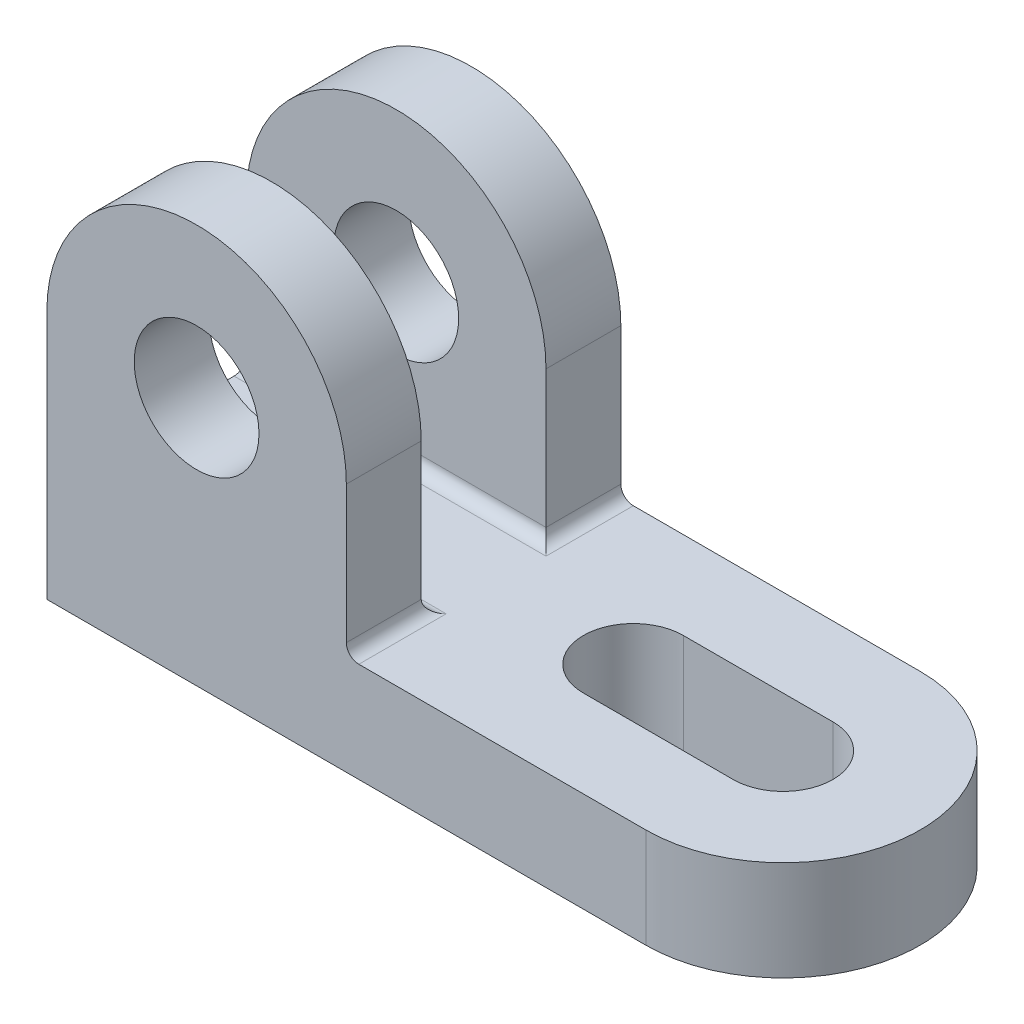
ISO-10303-21;
HEADER;
FILE_DESCRIPTION(('STEP AP214'),'2;1');
FILE_NAME('part.step','',(''),(''),'','','');
FILE_SCHEMA(('AUTOMOTIVE_DESIGN { 1 0 10303 214 1 1 1 1 }'));
ENDSEC;
DATA;
#1=APPLICATION_CONTEXT('core data for automotive mechanical design processes');
#2=APPLICATION_PROTOCOL_DEFINITION('international standard','automotive_design',2000,#1);
#3=PRODUCT_CONTEXT('',#1,'mechanical');
#4=PRODUCT('Part','Part','',(#3));
#5=PRODUCT_RELATED_PRODUCT_CATEGORY('part','',(#4));
#6=PRODUCT_DEFINITION_FORMATION('','',#4);
#7=PRODUCT_DEFINITION_CONTEXT('part definition',#1,'design');
#8=PRODUCT_DEFINITION('design','',#6,#7);
#9=PRODUCT_DEFINITION_SHAPE('','',#8);
#10=(LENGTH_UNIT() NAMED_UNIT(*) SI_UNIT(.MILLI.,.METRE.));
#11=(NAMED_UNIT(*) PLANE_ANGLE_UNIT() SI_UNIT($,.RADIAN.));
#12=(NAMED_UNIT(*) SI_UNIT($,.STERADIAN.) SOLID_ANGLE_UNIT());
#13=UNCERTAINTY_MEASURE_WITH_UNIT(LENGTH_MEASURE(1.E-05),#10,'distance_accuracy_value','');
#14=(GEOMETRIC_REPRESENTATION_CONTEXT(3) GLOBAL_UNCERTAINTY_ASSIGNED_CONTEXT((#13)) GLOBAL_UNIT_ASSIGNED_CONTEXT((#10,
#11,#12)) REPRESENTATION_CONTEXT('',''));
#15=CARTESIAN_POINT('',(0.,0.,0.));
#16=DIRECTION('',(0.,0.,1.));
#17=DIRECTION('',(1.,0.,0.));
#18=AXIS2_PLACEMENT_3D('',#15,#16,#17);
#19=CARTESIAN_POINT('',(24.,40.,-44.));
#20=DIRECTION('',(0.,0.,1.));
#21=DIRECTION('',(1.,0.,0.));
#22=AXIS2_PLACEMENT_3D('',#19,#20,#21);
#23=CYLINDRICAL_SURFACE('',#22,24.);
#24=CARTESIAN_POINT('',(24.,40.,-12.));
#25=DIRECTION('',(0.,0.,1.));
#26=DIRECTION('',(0.,-1.,0.));
#27=AXIS2_PLACEMENT_3D('',#24,#25,#26);
#28=CIRCLE('',#27,24.);
#29=CARTESIAN_POINT('',(0.,40.,-12.));
#30=VERTEX_POINT('',#29);
#31=CARTESIAN_POINT('',(48.,40.,-12.));
#32=VERTEX_POINT('',#31);
#33=EDGE_CURVE('E189',#30,#32,#28,.F.);
#34=ORIENTED_EDGE('',*,*,#33,.F.);
#35=DIRECTION('',(0.,0.,1.));
#36=VECTOR('',#35,1.);
#37=CARTESIAN_POINT('',(0.,40.,-44.));
#38=LINE('',#37,#36);
#39=CARTESIAN_POINT('',(0.,40.,0.));
#40=VERTEX_POINT('',#39);
#41=EDGE_CURVE('E203',#30,#40,#38,.T.);
#42=ORIENTED_EDGE('',*,*,#41,.T.);
#43=CARTESIAN_POINT('',(24.,40.,0.));
#44=DIRECTION('',(0.,0.,1.));
#45=DIRECTION('',(1.,0.,0.));
#46=AXIS2_PLACEMENT_3D('',#43,#44,#45);
#47=CIRCLE('',#46,24.);
#48=CARTESIAN_POINT('',(48.,40.,0.));
#49=VERTEX_POINT('',#48);
#50=EDGE_CURVE('E227',#49,#40,#47,.T.);
#51=ORIENTED_EDGE('',*,*,#50,.F.);
#52=DIRECTION('',(0.,0.,1.));
#53=VECTOR('',#52,1.);
#54=CARTESIAN_POINT('',(48.,40.,-44.));
#55=LINE('',#54,#53);
#56=EDGE_CURVE('E206',#32,#49,#55,.T.);
#57=ORIENTED_EDGE('',*,*,#56,.F.);
#58=EDGE_LOOP('',(#34,#42,#51,#57));
#59=FACE_BOUND('',#58,.T.);
#60=ADVANCED_FACE('F63',(#59),#23,.T.);
#61=CARTESIAN_POINT('',(48.,16.,-44.));
#62=DIRECTION('',(1.,0.,0.));
#63=DIRECTION('',(0.,0.,-1.));
#64=AXIS2_PLACEMENT_3D('',#61,#62,#63);
#65=PLANE('',#64);
#66=DIRECTION('',(0.,1.,0.));
#67=VECTOR('',#66,1.);
#68=CARTESIAN_POINT('',(48.,16.,-32.));
#69=LINE('',#68,#67);
#70=CARTESIAN_POINT('',(48.,18.,-32.));
#71=VERTEX_POINT('',#70);
#72=CARTESIAN_POINT('',(48.,40.,-32.));
#73=VERTEX_POINT('',#72);
#74=EDGE_CURVE('E350',#71,#73,#69,.T.);
#75=ORIENTED_EDGE('',*,*,#74,.F.);
#76=DIRECTION('',(0.,0.,1.));
#77=VECTOR('',#76,1.);
#78=CARTESIAN_POINT('',(48.,18.,-44.));
#79=LINE('',#78,#77);
#80=CARTESIAN_POINT('',(48.,18.,-44.));
#81=VERTEX_POINT('',#80);
#82=EDGE_CURVE('E87',#71,#81,#79,.F.);
#83=ORIENTED_EDGE('',*,*,#82,.T.);
#84=DIRECTION('',(0.,1.,0.));
#85=VECTOR('',#84,1.);
#86=CARTESIAN_POINT('',(48.,16.,-44.));
#87=LINE('',#86,#85);
#88=CARTESIAN_POINT('',(48.,40.,-44.));
#89=VERTEX_POINT('',#88);
#90=EDGE_CURVE('E388',#81,#89,#87,.T.);
#91=ORIENTED_EDGE('',*,*,#90,.T.);
#92=EDGE_CURVE('E218',#89,#73,#55,.T.);
#93=ORIENTED_EDGE('',*,*,#92,.T.);
#94=EDGE_LOOP('',(#75,#83,#91,#93));
#95=FACE_BOUND('',#94,.T.);
#96=ADVANCED_FACE('F424',(#95),#65,.T.);
#97=CARTESIAN_POINT('',(24.,40.,-44.));
#98=DIRECTION('',(0.,0.,1.));
#99=DIRECTION('',(1.,0.,0.));
#100=AXIS2_PLACEMENT_3D('',#97,#98,#99);
#101=CYLINDRICAL_SURFACE('',#100,10.);
#102=CARTESIAN_POINT('',(24.,40.,-32.));
#103=DIRECTION('',(0.,0.,-1.));
#104=DIRECTION('',(-1.,0.,0.));
#105=AXIS2_PLACEMENT_3D('',#102,#103,#104);
#106=CIRCLE('',#105,10.);
#107=CARTESIAN_POINT('',(14.,40.,-32.));
#108=VERTEX_POINT('',#107);
#109=EDGE_CURVE('E208',#108,#108,#106,.F.);
#110=ORIENTED_EDGE('',*,*,#109,.T.);
#111=EDGE_LOOP('',(#110));
#112=FACE_BOUND('',#111,.T.);
#113=CARTESIAN_POINT('',(24.,40.,-44.));
#114=DIRECTION('',(0.,0.,1.));
#115=DIRECTION('',(1.,0.,0.));
#116=AXIS2_PLACEMENT_3D('',#113,#114,#115);
#117=CIRCLE('',#116,10.);
#118=CARTESIAN_POINT('',(34.,40.,-44.));
#119=VERTEX_POINT('',#118);
#120=EDGE_CURVE('E380',#119,#119,#117,.T.);
#121=ORIENTED_EDGE('',*,*,#120,.F.);
#122=EDGE_LOOP('',(#121));
#123=FACE_BOUND('',#122,.T.);
#124=ADVANCED_FACE('F447',(#112,#123),#101,.F.);
#125=CARTESIAN_POINT('',(96.,16.,-22.));
#126=DIRECTION('',(0.,1.,0.));
#127=DIRECTION('',(0.,0.,1.));
#128=AXIS2_PLACEMENT_3D('',#125,#126,#127);
#129=PLANE('',#128);
#130=DIRECTION('',(-1.,0.,0.));
#131=VECTOR('',#130,1.);
#132=CARTESIAN_POINT('',(96.,16.,-30.));
#133=LINE('',#132,#131);
#134=CARTESIAN_POINT('',(96.,16.,-30.));
#135=VERTEX_POINT('',#134);
#136=CARTESIAN_POINT('',(72.,16.,-30.));
#137=VERTEX_POINT('',#136);
#138=EDGE_CURVE('E233',#135,#137,#133,.T.);
#139=ORIENTED_EDGE('',*,*,#138,.F.);
#140=CARTESIAN_POINT('',(96.,16.,-22.));
#141=DIRECTION('',(0.,1.,0.));
#142=DIRECTION('',(0.,0.,1.));
#143=AXIS2_PLACEMENT_3D('',#140,#141,#142);
#144=CIRCLE('',#143,8.);
#145=CARTESIAN_POINT('',(96.,16.,-14.));
#146=VERTEX_POINT('',#145);
#147=EDGE_CURVE('E230',#146,#135,#144,.T.);
#148=ORIENTED_EDGE('',*,*,#147,.F.);
#149=DIRECTION('',(-1.,0.,0.));
#150=VECTOR('',#149,1.);
#151=CARTESIAN_POINT('',(96.,16.,-14.));
#152=LINE('',#151,#150);
#153=CARTESIAN_POINT('',(72.,16.,-14.));
#154=VERTEX_POINT('',#153);
#155=EDGE_CURVE('E241',#146,#154,#152,.T.);
#156=ORIENTED_EDGE('',*,*,#155,.T.);
#157=CARTESIAN_POINT('',(72.,16.,-22.));
#158=DIRECTION('',(0.,1.,0.));
#159=DIRECTION('',(0.,0.,1.));
#160=AXIS2_PLACEMENT_3D('',#157,#158,#159);
#161=CIRCLE('',#160,8.);
#162=EDGE_CURVE('E237',#137,#154,#161,.T.);
#163=ORIENTED_EDGE('',*,*,#162,.F.);
#164=EDGE_LOOP('',(#139,#148,#156,#163));
#165=FACE_BOUND('',#164,.T.);
#166=DIRECTION('',(0.,0.,1.));
#167=VECTOR('',#166,1.);
#168=CARTESIAN_POINT('',(50.,16.,-32.));
#169=LINE('',#168,#167);
#170=CARTESIAN_POINT('',(50.,16.,-44.));
#171=VERTEX_POINT('',#170);
#172=CARTESIAN_POINT('',(50.,16.,-30.));
#173=VERTEX_POINT('',#172);
#174=EDGE_CURVE('E328',#171,#173,#169,.T.);
#175=ORIENTED_EDGE('',*,*,#174,.T.);
#176=DIRECTION('',(1.,0.,0.));
#177=VECTOR('',#176,1.);
#178=CARTESIAN_POINT('',(96.,16.,-30.));
#179=LINE('',#178,#177);
#180=CARTESIAN_POINT('',(0.,16.,-30.));
#181=VERTEX_POINT('',#180);
#182=EDGE_CURVE('E331',#173,#181,#179,.F.);
#183=ORIENTED_EDGE('',*,*,#182,.T.);
#184=DIRECTION('',(0.,0.,-1.));
#185=VECTOR('',#184,1.);
#186=CARTESIAN_POINT('',(0.,16.,-32.));
#187=LINE('',#186,#185);
#188=CARTESIAN_POINT('',(0.,16.,-14.));
#189=VERTEX_POINT('',#188);
#190=EDGE_CURVE('E197',#189,#181,#187,.T.);
#191=ORIENTED_EDGE('',*,*,#190,.F.);
#192=DIRECTION('',(1.,0.,0.));
#193=VECTOR('',#192,1.);
#194=CARTESIAN_POINT('',(96.,16.,-14.));
#195=LINE('',#194,#193);
#196=CARTESIAN_POINT('',(50.,16.,-14.));
#197=VERTEX_POINT('',#196);
#198=EDGE_CURVE('E324',#189,#197,#195,.T.);
#199=ORIENTED_EDGE('',*,*,#198,.T.);
#200=DIRECTION('',(0.,0.,1.));
#201=VECTOR('',#200,1.);
#202=CARTESIAN_POINT('',(50.,16.,0.));
#203=LINE('',#202,#201);
#204=CARTESIAN_POINT('',(50.,16.,0.));
#205=VERTEX_POINT('',#204);
#206=EDGE_CURVE('E321',#197,#205,#203,.T.);
#207=ORIENTED_EDGE('',*,*,#206,.T.);
#208=DIRECTION('',(1.,0.,0.));
#209=VECTOR('',#208,1.);
#210=CARTESIAN_POINT('',(0.,16.,0.));
#211=LINE('',#210,#209);
#212=CARTESIAN_POINT('',(96.,16.,0.));
#213=VERTEX_POINT('',#212);
#214=EDGE_CURVE('E282',#205,#213,#211,.T.);
#215=ORIENTED_EDGE('',*,*,#214,.T.);
#216=CARTESIAN_POINT('',(96.,16.,-22.));
#217=DIRECTION('',(0.,1.,0.));
#218=DIRECTION('',(0.,0.,1.));
#219=AXIS2_PLACEMENT_3D('',#216,#217,#218);
#220=CIRCLE('',#219,22.);
#221=CARTESIAN_POINT('',(96.,16.,-44.));
#222=VERTEX_POINT('',#221);
#223=EDGE_CURVE('E277',#213,#222,#220,.T.);
#224=ORIENTED_EDGE('',*,*,#223,.T.);
#225=DIRECTION('',(1.,0.,0.));
#226=VECTOR('',#225,1.);
#227=CARTESIAN_POINT('',(0.,16.,-44.));
#228=LINE('',#227,#226);
#229=EDGE_CURVE('E274',#171,#222,#228,.T.);
#230=ORIENTED_EDGE('',*,*,#229,.F.);
#231=EDGE_LOOP('',(#175,#183,#191,#199,#207,#215,#224,#230));
#232=FACE_BOUND('',#231,.T.);
#233=ADVANCED_FACE('F368',(#165,#232),#129,.T.);
#234=CARTESIAN_POINT('',(96.,0.,-22.));
#235=DIRECTION('',(0.,1.,0.));
#236=DIRECTION('',(0.,0.,1.));
#237=AXIS2_PLACEMENT_3D('',#234,#235,#236);
#238=PLANE('',#237);
#239=DIRECTION('',(0.,0.,-1.));
#240=VECTOR('',#239,1.);
#241=CARTESIAN_POINT('',(0.,0.,0.));
#242=LINE('',#241,#240);
#243=CARTESIAN_POINT('',(0.,0.,0.));
#244=VERTEX_POINT('',#243);
#245=CARTESIAN_POINT('',(0.,0.,-44.));
#246=VERTEX_POINT('',#245);
#247=EDGE_CURVE('E273',#244,#246,#242,.T.);
#248=ORIENTED_EDGE('',*,*,#247,.T.);
#249=DIRECTION('',(1.,0.,0.));
#250=VECTOR('',#249,1.);
#251=CARTESIAN_POINT('',(0.,0.,-44.));
#252=LINE('',#251,#250);
#253=CARTESIAN_POINT('',(96.,0.,-44.));
#254=VERTEX_POINT('',#253);
#255=EDGE_CURVE('E289',#246,#254,#252,.T.);
#256=ORIENTED_EDGE('',*,*,#255,.T.);
#257=CARTESIAN_POINT('',(96.,0.,-22.));
#258=DIRECTION('',(0.,1.,0.));
#259=DIRECTION('',(0.,0.,1.));
#260=AXIS2_PLACEMENT_3D('',#257,#258,#259);
#261=CIRCLE('',#260,22.);
#262=CARTESIAN_POINT('',(96.,0.,0.));
#263=VERTEX_POINT('',#262);
#264=EDGE_CURVE('E293',#263,#254,#261,.T.);
#265=ORIENTED_EDGE('',*,*,#264,.F.);
#266=DIRECTION('',(1.,0.,0.));
#267=VECTOR('',#266,1.);
#268=CARTESIAN_POINT('',(0.,0.,0.));
#269=LINE('',#268,#267);
#270=EDGE_CURVE('E278',#244,#263,#269,.T.);
#271=ORIENTED_EDGE('',*,*,#270,.F.);
#272=EDGE_LOOP('',(#248,#256,#265,#271));
#273=FACE_BOUND('',#272,.T.);
#274=CARTESIAN_POINT('',(96.,0.,-22.));
#275=DIRECTION('',(0.,1.,0.));
#276=DIRECTION('',(0.,0.,1.));
#277=AXIS2_PLACEMENT_3D('',#274,#275,#276);
#278=CIRCLE('',#277,8.);
#279=CARTESIAN_POINT('',(96.,0.,-14.));
#280=VERTEX_POINT('',#279);
#281=CARTESIAN_POINT('',(96.,0.,-30.));
#282=VERTEX_POINT('',#281);
#283=EDGE_CURVE('E223',#280,#282,#278,.T.);
#284=ORIENTED_EDGE('',*,*,#283,.T.);
#285=DIRECTION('',(-1.,0.,0.));
#286=VECTOR('',#285,1.);
#287=CARTESIAN_POINT('',(96.,0.,-30.));
#288=LINE('',#287,#286);
#289=CARTESIAN_POINT('',(72.,0.,-30.));
#290=VERTEX_POINT('',#289);
#291=EDGE_CURVE('E249',#282,#290,#288,.T.);
#292=ORIENTED_EDGE('',*,*,#291,.T.);
#293=CARTESIAN_POINT('',(72.,0.,-22.));
#294=DIRECTION('',(0.,1.,0.));
#295=DIRECTION('',(0.,0.,1.));
#296=AXIS2_PLACEMENT_3D('',#293,#294,#295);
#297=CIRCLE('',#296,8.);
#298=CARTESIAN_POINT('',(72.,0.,-14.));
#299=VERTEX_POINT('',#298);
#300=EDGE_CURVE('E253',#290,#299,#297,.T.);
#301=ORIENTED_EDGE('',*,*,#300,.T.);
#302=DIRECTION('',(-1.,0.,0.));
#303=VECTOR('',#302,1.);
#304=CARTESIAN_POINT('',(96.,0.,-14.));
#305=LINE('',#304,#303);
#306=EDGE_CURVE('E234',#280,#299,#305,.T.);
#307=ORIENTED_EDGE('',*,*,#306,.F.);
#308=EDGE_LOOP('',(#284,#292,#301,#307));
#309=FACE_BOUND('',#308,.T.);
#310=ADVANCED_FACE('F402',(#273,#309),#238,.F.);
#311=CARTESIAN_POINT('',(0.,16.,0.));
#312=DIRECTION('',(-1.,0.,0.));
#313=DIRECTION('',(0.,0.,1.));
#314=AXIS2_PLACEMENT_3D('',#311,#312,#313);
#315=PLANE('',#314);
#316=ORIENTED_EDGE('',*,*,#190,.T.);
#317=CARTESIAN_POINT('',(0.,18.,-30.));
#318=DIRECTION('',(-1.,0.,0.));
#319=DIRECTION('',(0.,0.,1.));
#320=AXIS2_PLACEMENT_3D('',#317,#318,#319);
#321=CIRCLE('',#320,2.);
#322=CARTESIAN_POINT('',(0.,18.,-32.));
#323=VERTEX_POINT('',#322);
#324=EDGE_CURVE('E341',#181,#323,#321,.F.);
#325=ORIENTED_EDGE('',*,*,#324,.T.);
#326=DIRECTION('',(0.,1.,0.));
#327=VECTOR('',#326,1.);
#328=CARTESIAN_POINT('',(0.,16.,-32.));
#329=LINE('',#328,#327);
#330=CARTESIAN_POINT('',(0.,40.,-32.));
#331=VERTEX_POINT('',#330);
#332=EDGE_CURVE('E198',#323,#331,#329,.T.);
#333=ORIENTED_EDGE('',*,*,#332,.T.);
#334=CARTESIAN_POINT('',(0.,40.,-44.));
#335=VERTEX_POINT('',#334);
#336=EDGE_CURVE('E217',#335,#331,#38,.T.);
#337=ORIENTED_EDGE('',*,*,#336,.F.);
#338=DIRECTION('',(0.,-1.,0.));
#339=VECTOR('',#338,1.);
#340=CARTESIAN_POINT('',(0.,16.,-44.));
#341=LINE('',#340,#339);
#342=EDGE_CURVE('E285',#335,#246,#341,.T.);
#343=ORIENTED_EDGE('',*,*,#342,.T.);
#344=ORIENTED_EDGE('',*,*,#247,.F.);
#345=DIRECTION('',(0.,-1.,0.));
#346=VECTOR('',#345,1.);
#347=CARTESIAN_POINT('',(0.,16.,0.));
#348=LINE('',#347,#346);
#349=EDGE_CURVE('E214',#40,#244,#348,.T.);
#350=ORIENTED_EDGE('',*,*,#349,.F.);
#351=ORIENTED_EDGE('',*,*,#41,.F.);
#352=DIRECTION('',(0.,-1.,0.));
#353=VECTOR('',#352,1.);
#354=CARTESIAN_POINT('',(0.,16.,-12.));
#355=LINE('',#354,#353);
#356=CARTESIAN_POINT('',(0.,18.,-12.));
#357=VERTEX_POINT('',#356);
#358=EDGE_CURVE('E184',#30,#357,#355,.T.);
#359=ORIENTED_EDGE('',*,*,#358,.T.);
#360=CARTESIAN_POINT('',(0.,18.,-14.));
#361=DIRECTION('',(-1.,0.,0.));
#362=DIRECTION('',(0.,0.,1.));
#363=AXIS2_PLACEMENT_3D('',#360,#361,#362);
#364=CIRCLE('',#363,2.);
#365=EDGE_CURVE('E344',#357,#189,#364,.F.);
#366=ORIENTED_EDGE('',*,*,#365,.T.);
#367=EDGE_LOOP('',(#316,#325,#333,#337,#343,#344,#350,#351,#359,#366));
#368=FACE_BOUND('',#367,.T.);
#369=ADVANCED_FACE('F212',(#368),#315,.T.);
#370=CARTESIAN_POINT('',(0.,16.,0.));
#371=DIRECTION('',(0.,0.,-1.));
#372=DIRECTION('',(-1.,0.,0.));
#373=AXIS2_PLACEMENT_3D('',#370,#371,#372);
#374=PLANE('',#373);
#375=ORIENTED_EDGE('',*,*,#270,.T.);
#376=DIRECTION('',(0.,-1.,0.));
#377=VECTOR('',#376,1.);
#378=CARTESIAN_POINT('',(96.,16.,0.));
#379=LINE('',#378,#377);
#380=EDGE_CURVE('E302',#213,#263,#379,.T.);
#381=ORIENTED_EDGE('',*,*,#380,.F.);
#382=ORIENTED_EDGE('',*,*,#214,.F.);
#383=CARTESIAN_POINT('',(50.,18.,0.));
#384=DIRECTION('',(0.,0.,-1.));
#385=DIRECTION('',(-1.,0.,0.));
#386=AXIS2_PLACEMENT_3D('',#383,#384,#385);
#387=CIRCLE('',#386,2.);
#388=CARTESIAN_POINT('',(48.,18.,0.));
#389=VERTEX_POINT('',#388);
#390=EDGE_CURVE('E12',#205,#389,#387,.T.);
#391=ORIENTED_EDGE('',*,*,#390,.T.);
#392=DIRECTION('',(0.,1.,0.));
#393=VECTOR('',#392,1.);
#394=CARTESIAN_POINT('',(48.,16.,0.));
#395=LINE('',#394,#393);
#396=EDGE_CURVE('E384',#389,#49,#395,.T.);
#397=ORIENTED_EDGE('',*,*,#396,.T.);
#398=ORIENTED_EDGE('',*,*,#50,.T.);
#399=ORIENTED_EDGE('',*,*,#349,.T.);
#400=EDGE_LOOP('',(#375,#381,#382,#391,#397,#398,#399));
#401=FACE_BOUND('',#400,.T.);
#402=CARTESIAN_POINT('',(24.,40.,0.));
#403=DIRECTION('',(0.,0.,1.));
#404=DIRECTION('',(1.,0.,0.));
#405=AXIS2_PLACEMENT_3D('',#402,#403,#404);
#406=CIRCLE('',#405,10.);
#407=CARTESIAN_POINT('',(34.,40.,0.));
#408=VERTEX_POINT('',#407);
#409=EDGE_CURVE('E379',#408,#408,#406,.T.);
#410=ORIENTED_EDGE('',*,*,#409,.F.);
#411=EDGE_LOOP('',(#410));
#412=FACE_BOUND('',#411,.T.);
#413=ADVANCED_FACE('F396',(#401,#412),#374,.F.);
#414=CARTESIAN_POINT('',(96.,16.,-22.));
#415=DIRECTION('',(0.,-1.,0.));
#416=DIRECTION('',(0.,0.,-1.));
#417=AXIS2_PLACEMENT_3D('',#414,#415,#416);
#418=CYLINDRICAL_SURFACE('',#417,22.);
#419=ORIENTED_EDGE('',*,*,#264,.T.);
#420=DIRECTION('',(0.,-1.,0.));
#421=VECTOR('',#420,1.);
#422=CARTESIAN_POINT('',(96.,16.,-44.));
#423=LINE('',#422,#421);
#424=EDGE_CURVE('E306',#222,#254,#423,.T.);
#425=ORIENTED_EDGE('',*,*,#424,.F.);
#426=ORIENTED_EDGE('',*,*,#223,.F.);
#427=ORIENTED_EDGE('',*,*,#380,.T.);
#428=EDGE_LOOP('',(#419,#425,#426,#427));
#429=FACE_BOUND('',#428,.T.);
#430=ADVANCED_FACE('F414',(#429),#418,.T.);
#431=CARTESIAN_POINT('',(0.,16.,-44.));
#432=DIRECTION('',(0.,0.,-1.));
#433=DIRECTION('',(-1.,0.,0.));
#434=AXIS2_PLACEMENT_3D('',#431,#432,#433);
#435=PLANE('',#434);
#436=ORIENTED_EDGE('',*,*,#255,.F.);
#437=ORIENTED_EDGE('',*,*,#342,.F.);
#438=CARTESIAN_POINT('',(24.,40.,-44.));
#439=DIRECTION('',(0.,0.,1.));
#440=DIRECTION('',(1.,0.,0.));
#441=AXIS2_PLACEMENT_3D('',#438,#439,#440);
#442=CIRCLE('',#441,24.);
#443=EDGE_CURVE('E391',#89,#335,#442,.T.);
#444=ORIENTED_EDGE('',*,*,#443,.F.);
#445=ORIENTED_EDGE('',*,*,#90,.F.);
#446=CARTESIAN_POINT('',(50.,18.,-44.));
#447=DIRECTION('',(0.,0.,-1.));
#448=DIRECTION('',(-1.,0.,0.));
#449=AXIS2_PLACEMENT_3D('',#446,#447,#448);
#450=CIRCLE('',#449,2.);
#451=EDGE_CURVE('E73',#81,#171,#450,.F.);
#452=ORIENTED_EDGE('',*,*,#451,.T.);
#453=ORIENTED_EDGE('',*,*,#229,.T.);
#454=ORIENTED_EDGE('',*,*,#424,.T.);
#455=EDGE_LOOP('',(#436,#437,#444,#445,#452,#453,#454));
#456=FACE_BOUND('',#455,.T.);
#457=ORIENTED_EDGE('',*,*,#120,.T.);
#458=EDGE_LOOP('',(#457));
#459=FACE_BOUND('',#458,.T.);
#460=ADVANCED_FACE('F408',(#456,#459),#435,.T.);
#461=CARTESIAN_POINT('',(96.,16.,-22.));
#462=DIRECTION('',(0.,-1.,0.));
#463=DIRECTION('',(0.,0.,-1.));
#464=AXIS2_PLACEMENT_3D('',#461,#462,#463);
#465=CYLINDRICAL_SURFACE('',#464,8.);
#466=ORIENTED_EDGE('',*,*,#283,.F.);
#467=DIRECTION('',(0.,-1.,0.));
#468=VECTOR('',#467,1.);
#469=CARTESIAN_POINT('',(96.,16.,-14.));
#470=LINE('',#469,#468);
#471=EDGE_CURVE('E245',#146,#280,#470,.T.);
#472=ORIENTED_EDGE('',*,*,#471,.F.);
#473=ORIENTED_EDGE('',*,*,#147,.T.);
#474=DIRECTION('',(0.,-1.,0.));
#475=VECTOR('',#474,1.);
#476=CARTESIAN_POINT('',(96.,16.,-30.));
#477=LINE('',#476,#475);
#478=EDGE_CURVE('E269',#135,#282,#477,.T.);
#479=ORIENTED_EDGE('',*,*,#478,.T.);
#480=EDGE_LOOP('',(#466,#472,#473,#479));
#481=FACE_BOUND('',#480,.T.);
#482=ADVANCED_FACE('F459',(#481),#465,.F.);
#483=CARTESIAN_POINT('',(96.,16.,-30.));
#484=DIRECTION('',(0.,0.,1.));
#485=DIRECTION('',(1.,0.,0.));
#486=AXIS2_PLACEMENT_3D('',#483,#484,#485);
#487=PLANE('',#486);
#488=ORIENTED_EDGE('',*,*,#291,.F.);
#489=ORIENTED_EDGE('',*,*,#478,.F.);
#490=ORIENTED_EDGE('',*,*,#138,.T.);
#491=DIRECTION('',(0.,-1.,0.));
#492=VECTOR('',#491,1.);
#493=CARTESIAN_POINT('',(72.,16.,-30.));
#494=LINE('',#493,#492);
#495=EDGE_CURVE('E266',#137,#290,#494,.T.);
#496=ORIENTED_EDGE('',*,*,#495,.T.);
#497=EDGE_LOOP('',(#488,#489,#490,#496));
#498=FACE_BOUND('',#497,.T.);
#499=ADVANCED_FACE('F455',(#498),#487,.T.);
#500=CARTESIAN_POINT('',(72.,16.,-22.));
#501=DIRECTION('',(0.,-1.,0.));
#502=DIRECTION('',(0.,0.,-1.));
#503=AXIS2_PLACEMENT_3D('',#500,#501,#502);
#504=CYLINDRICAL_SURFACE('',#503,8.);
#505=ORIENTED_EDGE('',*,*,#300,.F.);
#506=ORIENTED_EDGE('',*,*,#495,.F.);
#507=ORIENTED_EDGE('',*,*,#162,.T.);
#508=DIRECTION('',(0.,-1.,0.));
#509=VECTOR('',#508,1.);
#510=CARTESIAN_POINT('',(72.,16.,-14.));
#511=LINE('',#510,#509);
#512=EDGE_CURVE('E263',#154,#299,#511,.T.);
#513=ORIENTED_EDGE('',*,*,#512,.T.);
#514=EDGE_LOOP('',(#505,#506,#507,#513));
#515=FACE_BOUND('',#514,.T.);
#516=ADVANCED_FACE('F439',(#515),#504,.F.);
#517=CARTESIAN_POINT('',(96.,16.,-14.));
#518=DIRECTION('',(0.,0.,1.));
#519=DIRECTION('',(1.,0.,0.));
#520=AXIS2_PLACEMENT_3D('',#517,#518,#519);
#521=PLANE('',#520);
#522=ORIENTED_EDGE('',*,*,#306,.T.);
#523=ORIENTED_EDGE('',*,*,#512,.F.);
#524=ORIENTED_EDGE('',*,*,#155,.F.);
#525=ORIENTED_EDGE('',*,*,#471,.T.);
#526=EDGE_LOOP('',(#522,#523,#524,#525));
#527=FACE_BOUND('',#526,.T.);
#528=ADVANCED_FACE('F430',(#527),#521,.F.);
#529=CARTESIAN_POINT('',(24.,40.,-32.));
#530=DIRECTION('',(0.,0.,-1.));
#531=DIRECTION('',(-1.,0.,0.));
#532=AXIS2_PLACEMENT_3D('',#529,#530,#531);
#533=CIRCLE('',#532,24.);
#534=EDGE_CURVE('E317',#73,#331,#533,.F.);
#535=ORIENTED_EDGE('',*,*,#534,.F.);
#536=ORIENTED_EDGE('',*,*,#92,.F.);
#537=ORIENTED_EDGE('',*,*,#443,.T.);
#538=ORIENTED_EDGE('',*,*,#336,.T.);
#539=EDGE_LOOP('',(#535,#536,#537,#538));
#540=FACE_BOUND('',#539,.T.);
#541=ADVANCED_FACE('F427',(#540),#23,.T.);
#542=ORIENTED_EDGE('',*,*,#396,.F.);
#543=DIRECTION('',(0.,0.,1.));
#544=VECTOR('',#543,1.);
#545=CARTESIAN_POINT('',(48.,18.,-12.));
#546=LINE('',#545,#544);
#547=CARTESIAN_POINT('',(48.,18.,-12.));
#548=VERTEX_POINT('',#547);
#549=EDGE_CURVE('E338',#389,#548,#546,.F.);
#550=ORIENTED_EDGE('',*,*,#549,.T.);
#551=DIRECTION('',(0.,-1.,0.));
#552=VECTOR('',#551,1.);
#553=CARTESIAN_POINT('',(48.,16.,-12.));
#554=LINE('',#553,#552);
#555=EDGE_CURVE('E357',#32,#548,#554,.T.);
#556=ORIENTED_EDGE('',*,*,#555,.F.);
#557=ORIENTED_EDGE('',*,*,#56,.T.);
#558=EDGE_LOOP('',(#542,#550,#556,#557));
#559=FACE_BOUND('',#558,.T.);
#560=ADVANCED_FACE('F429',(#559),#65,.T.);
#561=CARTESIAN_POINT('',(24.,40.,-12.));
#562=DIRECTION('',(0.,0.,1.));
#563=DIRECTION('',(0.,-1.,0.));
#564=AXIS2_PLACEMENT_3D('',#561,#562,#563);
#565=CIRCLE('',#564,10.);
#566=CARTESIAN_POINT('',(24.,30.,-12.));
#567=VERTEX_POINT('',#566);
#568=EDGE_CURVE('E209',#567,#567,#565,.F.);
#569=ORIENTED_EDGE('',*,*,#568,.T.);
#570=EDGE_LOOP('',(#569));
#571=FACE_BOUND('',#570,.T.);
#572=ORIENTED_EDGE('',*,*,#409,.T.);
#573=EDGE_LOOP('',(#572));
#574=FACE_BOUND('',#573,.T.);
#575=ADVANCED_FACE('F436',(#571,#574),#101,.F.);
#576=CARTESIAN_POINT('',(0.,16.,-32.));
#577=DIRECTION('',(0.,0.,-1.));
#578=DIRECTION('',(-1.,0.,0.));
#579=AXIS2_PLACEMENT_3D('',#576,#577,#578);
#580=PLANE('',#579);
#581=ORIENTED_EDGE('',*,*,#332,.F.);
#582=DIRECTION('',(1.,0.,0.));
#583=VECTOR('',#582,1.);
#584=CARTESIAN_POINT('',(0.,18.,-32.));
#585=LINE('',#584,#583);
#586=EDGE_CURVE('E301',#323,#71,#585,.T.);
#587=ORIENTED_EDGE('',*,*,#586,.T.);
#588=ORIENTED_EDGE('',*,*,#74,.T.);
#589=ORIENTED_EDGE('',*,*,#534,.T.);
#590=EDGE_LOOP('',(#581,#587,#588,#589));
#591=FACE_BOUND('',#590,.T.);
#592=ORIENTED_EDGE('',*,*,#109,.F.);
#593=EDGE_LOOP('',(#592));
#594=FACE_BOUND('',#593,.T.);
#595=ADVANCED_FACE('F421',(#591,#594),#580,.F.);
#596=CARTESIAN_POINT('',(0.,16.,-12.));
#597=DIRECTION('',(0.,0.,1.));
#598=DIRECTION('',(0.,-1.,0.));
#599=AXIS2_PLACEMENT_3D('',#596,#597,#598);
#600=PLANE('',#599);
#601=ORIENTED_EDGE('',*,*,#555,.T.);
#602=DIRECTION('',(1.,0.,0.));
#603=VECTOR('',#602,1.);
#604=CARTESIAN_POINT('',(0.,18.,-12.));
#605=LINE('',#604,#603);
#606=EDGE_CURVE('E192',#548,#357,#605,.F.);
#607=ORIENTED_EDGE('',*,*,#606,.T.);
#608=ORIENTED_EDGE('',*,*,#358,.F.);
#609=ORIENTED_EDGE('',*,*,#33,.T.);
#610=EDGE_LOOP('',(#601,#607,#608,#609));
#611=FACE_BOUND('',#610,.T.);
#612=ORIENTED_EDGE('',*,*,#568,.F.);
#613=EDGE_LOOP('',(#612));
#614=FACE_BOUND('',#613,.T.);
#615=ADVANCED_FACE('F187',(#611,#614),#600,.F.);
#616=CARTESIAN_POINT('',(50.,18.,-22.));
#617=DIRECTION('',(0.,0.,-1.));
#618=DIRECTION('',(-1.,0.,0.));
#619=AXIS2_PLACEMENT_3D('',#616,#617,#618);
#620=CYLINDRICAL_SURFACE('',#619,2.);
#621=ORIENTED_EDGE('',*,*,#451,.F.);
#622=ORIENTED_EDGE('',*,*,#82,.F.);
#623=CARTESIAN_POINT('',(50.,18.,-30.));
#624=DIRECTION('',(0.707106781186547,0.,-0.707106781186547));
#625=DIRECTION('',(-0.707106781186547,0.,-0.707106781186547));
#626=AXIS2_PLACEMENT_3D('',#623,#624,#625);
#627=ELLIPSE('',#626,2.82842712474619,2.);
#628=EDGE_CURVE('E348',#173,#71,#627,.T.);
#629=ORIENTED_EDGE('',*,*,#628,.F.);
#630=ORIENTED_EDGE('',*,*,#174,.F.);
#631=EDGE_LOOP('',(#621,#622,#629,#630));
#632=FACE_BOUND('',#631,.T.);
#633=ADVANCED_FACE('F418',(#632),#620,.F.);
#634=CARTESIAN_POINT('',(0.,18.,-30.));
#635=DIRECTION('',(1.,0.,0.));
#636=DIRECTION('',(0.,0.,-1.));
#637=AXIS2_PLACEMENT_3D('',#634,#635,#636);
#638=CYLINDRICAL_SURFACE('',#637,2.);
#639=ORIENTED_EDGE('',*,*,#324,.F.);
#640=ORIENTED_EDGE('',*,*,#182,.F.);
#641=ORIENTED_EDGE('',*,*,#628,.T.);
#642=ORIENTED_EDGE('',*,*,#586,.F.);
#643=EDGE_LOOP('',(#639,#640,#641,#642));
#644=FACE_BOUND('',#643,.T.);
#645=ADVANCED_FACE('F477',(#644),#638,.F.);
#646=CARTESIAN_POINT('',(50.,18.,-22.));
#647=DIRECTION('',(0.,0.,-1.));
#648=DIRECTION('',(-1.,0.,0.));
#649=AXIS2_PLACEMENT_3D('',#646,#647,#648);
#650=CYLINDRICAL_SURFACE('',#649,2.);
#651=ORIENTED_EDGE('',*,*,#390,.F.);
#652=ORIENTED_EDGE('',*,*,#206,.F.);
#653=CARTESIAN_POINT('',(50.,18.,-14.));
#654=DIRECTION('',(-0.707106781186547,0.,-0.707106781186547));
#655=DIRECTION('',(0.707106781186547,0.,-0.707106781186547));
#656=AXIS2_PLACEMENT_3D('',#653,#654,#655);
#657=ELLIPSE('',#656,2.82842712474619,2.);
#658=EDGE_CURVE('E67',#548,#197,#657,.F.);
#659=ORIENTED_EDGE('',*,*,#658,.F.);
#660=ORIENTED_EDGE('',*,*,#549,.F.);
#661=EDGE_LOOP('',(#651,#652,#659,#660));
#662=FACE_BOUND('',#661,.T.);
#663=ADVANCED_FACE('F65',(#662),#650,.F.);
#664=CARTESIAN_POINT('',(96.,18.,-14.));
#665=DIRECTION('',(1.,0.,0.));
#666=DIRECTION('',(0.,0.,-1.));
#667=AXIS2_PLACEMENT_3D('',#664,#665,#666);
#668=CYLINDRICAL_SURFACE('',#667,2.);
#669=ORIENTED_EDGE('',*,*,#365,.F.);
#670=ORIENTED_EDGE('',*,*,#606,.F.);
#671=ORIENTED_EDGE('',*,*,#658,.T.);
#672=ORIENTED_EDGE('',*,*,#198,.F.);
#673=EDGE_LOOP('',(#669,#670,#671,#672));
#674=FACE_BOUND('',#673,.T.);
#675=ADVANCED_FACE('F363',(#674),#668,.F.);
#676=CLOSED_SHELL('',(#60,#96,#124,#233,#310,#369,#413,#430,#460,#482,#499,#516,#528,#541,#560,
#575,#595,#615,#633,#645,#663,#675));
#677=MANIFOLD_SOLID_BREP('B2',#676);
#678=ADVANCED_BREP_SHAPE_REPRESENTATION('',(#18,#677),#14);
#679=SHAPE_DEFINITION_REPRESENTATION(#9,#678);
ENDSEC;
END-ISO-10303-21;
